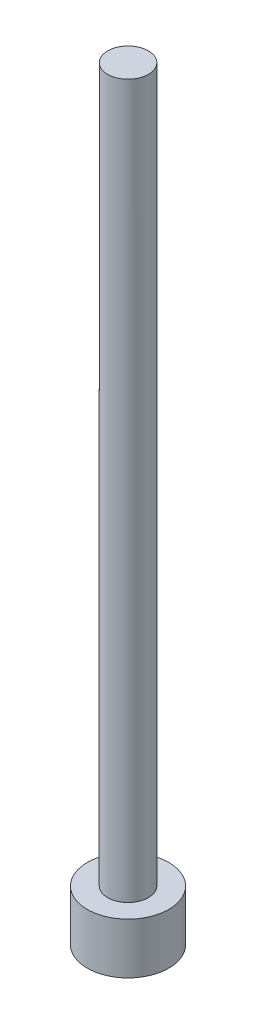
ISO-10303-21;
HEADER;
FILE_DESCRIPTION(('STEP AP214'),'2;1');
FILE_NAME('part.step','',(''),(''),'','','');
FILE_SCHEMA(('AUTOMOTIVE_DESIGN { 1 0 10303 214 1 1 1 1 }'));
ENDSEC;
DATA;
#1=APPLICATION_CONTEXT('core data for automotive mechanical design processes');
#2=APPLICATION_PROTOCOL_DEFINITION('international standard','automotive_design',2000,#1);
#3=PRODUCT_CONTEXT('',#1,'mechanical');
#4=PRODUCT('Part','Part','',(#3));
#5=PRODUCT_RELATED_PRODUCT_CATEGORY('part','',(#4));
#6=PRODUCT_DEFINITION_FORMATION('','',#4);
#7=PRODUCT_DEFINITION_CONTEXT('part definition',#1,'design');
#8=PRODUCT_DEFINITION('design','',#6,#7);
#9=PRODUCT_DEFINITION_SHAPE('','',#8);
#10=(LENGTH_UNIT() NAMED_UNIT(*) SI_UNIT(.MILLI.,.METRE.));
#11=(NAMED_UNIT(*) PLANE_ANGLE_UNIT() SI_UNIT($,.RADIAN.));
#12=(NAMED_UNIT(*) SI_UNIT($,.STERADIAN.) SOLID_ANGLE_UNIT());
#13=UNCERTAINTY_MEASURE_WITH_UNIT(LENGTH_MEASURE(1.E-05),#10,'distance_accuracy_value','');
#14=(GEOMETRIC_REPRESENTATION_CONTEXT(3) GLOBAL_UNCERTAINTY_ASSIGNED_CONTEXT((#13)) GLOBAL_UNIT_ASSIGNED_CONTEXT((#10,
#11,#12)) REPRESENTATION_CONTEXT('',''));
#15=CARTESIAN_POINT('',(0.,0.,0.));
#16=DIRECTION('',(0.,0.,1.));
#17=DIRECTION('',(1.,0.,0.));
#18=AXIS2_PLACEMENT_3D('',#15,#16,#17);
#19=CARTESIAN_POINT('',(0.,150.,0.));
#20=DIRECTION('',(0.,-1.,0.));
#21=DIRECTION('',(0.,0.,-1.));
#22=AXIS2_PLACEMENT_3D('',#19,#20,#21);
#23=CYLINDRICAL_SURFACE('',#22,4.);
#24=CARTESIAN_POINT('',(0.,150.,0.));
#25=DIRECTION('',(0.,1.,0.));
#26=DIRECTION('',(0.,0.,1.));
#27=AXIS2_PLACEMENT_3D('',#24,#25,#26);
#28=CIRCLE('',#27,4.);
#29=CARTESIAN_POINT('',(0.,150.,4.));
#30=VERTEX_POINT('',#29);
#31=EDGE_CURVE('E52',#30,#30,#28,.T.);
#32=ORIENTED_EDGE('',*,*,#31,.F.);
#33=EDGE_LOOP('',(#32));
#34=FACE_BOUND('',#33,.T.);
#35=CARTESIAN_POINT('',(0.,10.,0.));
#36=DIRECTION('',(0.,-1.,0.));
#37=DIRECTION('',(0.,0.,-1.));
#38=AXIS2_PLACEMENT_3D('',#35,#36,#37);
#39=CIRCLE('',#38,4.);
#40=CARTESIAN_POINT('',(0.,10.,-4.));
#41=VERTEX_POINT('',#40);
#42=EDGE_CURVE('E10',#41,#41,#39,.T.);
#43=ORIENTED_EDGE('',*,*,#42,.F.);
#44=EDGE_LOOP('',(#43));
#45=FACE_BOUND('',#44,.T.);
#46=ADVANCED_FACE('F45',(#34,#45),#23,.T.);
#47=CARTESIAN_POINT('',(0.,150.,0.));
#48=DIRECTION('',(0.,1.,0.));
#49=DIRECTION('',(0.,0.,1.));
#50=AXIS2_PLACEMENT_3D('',#47,#48,#49);
#51=PLANE('',#50);
#52=ORIENTED_EDGE('',*,*,#31,.T.);
#53=EDGE_LOOP('',(#52));
#54=FACE_BOUND('',#53,.T.);
#55=ADVANCED_FACE('F74',(#54),#51,.T.);
#56=CARTESIAN_POINT('',(0.,10.,0.));
#57=DIRECTION('',(0.,-1.,0.));
#58=DIRECTION('',(0.,0.,-1.));
#59=AXIS2_PLACEMENT_3D('',#56,#57,#58);
#60=CYLINDRICAL_SURFACE('',#59,8.);
#61=CARTESIAN_POINT('',(0.,10.,0.));
#62=DIRECTION('',(0.,-1.,0.));
#63=DIRECTION('',(0.,0.,-1.));
#64=AXIS2_PLACEMENT_3D('',#61,#62,#63);
#65=CIRCLE('',#64,8.);
#66=CARTESIAN_POINT('',(0.,10.,-8.));
#67=VERTEX_POINT('',#66);
#68=EDGE_CURVE('E57',#67,#67,#65,.T.);
#69=ORIENTED_EDGE('',*,*,#68,.T.);
#70=EDGE_LOOP('',(#69));
#71=FACE_BOUND('',#70,.T.);
#72=CARTESIAN_POINT('',(0.,0.,0.));
#73=DIRECTION('',(0.,-1.,0.));
#74=DIRECTION('',(0.,0.,-1.));
#75=AXIS2_PLACEMENT_3D('',#72,#73,#74);
#76=CIRCLE('',#75,8.);
#77=CARTESIAN_POINT('',(0.,0.,-8.));
#78=VERTEX_POINT('',#77);
#79=EDGE_CURVE('E62',#78,#78,#76,.T.);
#80=ORIENTED_EDGE('',*,*,#79,.F.);
#81=EDGE_LOOP('',(#80));
#82=FACE_BOUND('',#81,.T.);
#83=ADVANCED_FACE('F71',(#71,#82),#60,.T.);
#84=CARTESIAN_POINT('',(0.,10.,0.));
#85=DIRECTION('',(0.,-1.,0.));
#86=DIRECTION('',(0.,0.,-1.));
#87=AXIS2_PLACEMENT_3D('',#84,#85,#86);
#88=PLANE('',#87);
#89=ORIENTED_EDGE('',*,*,#42,.T.);
#90=EDGE_LOOP('',(#89));
#91=FACE_BOUND('',#90,.T.);
#92=ORIENTED_EDGE('',*,*,#68,.F.);
#93=EDGE_LOOP('',(#92));
#94=FACE_BOUND('',#93,.T.);
#95=ADVANCED_FACE('F73',(#91,#94),#88,.F.);
#96=CARTESIAN_POINT('',(0.,0.,0.));
#97=DIRECTION('',(0.,1.,0.));
#98=DIRECTION('',(0.,0.,1.));
#99=AXIS2_PLACEMENT_3D('',#96,#97,#98);
#100=PLANE('',#99);
#101=ORIENTED_EDGE('',*,*,#79,.T.);
#102=EDGE_LOOP('',(#101));
#103=FACE_BOUND('',#102,.T.);
#104=ADVANCED_FACE('F69',(#103),#100,.F.);
#105=CLOSED_SHELL('',(#46,#55,#83,#95,#104));
#106=MANIFOLD_SOLID_BREP('B2',#105);
#107=ADVANCED_BREP_SHAPE_REPRESENTATION('',(#18,#106),#14);
#108=SHAPE_DEFINITION_REPRESENTATION(#9,#107);
ENDSEC;
END-ISO-10303-21;
